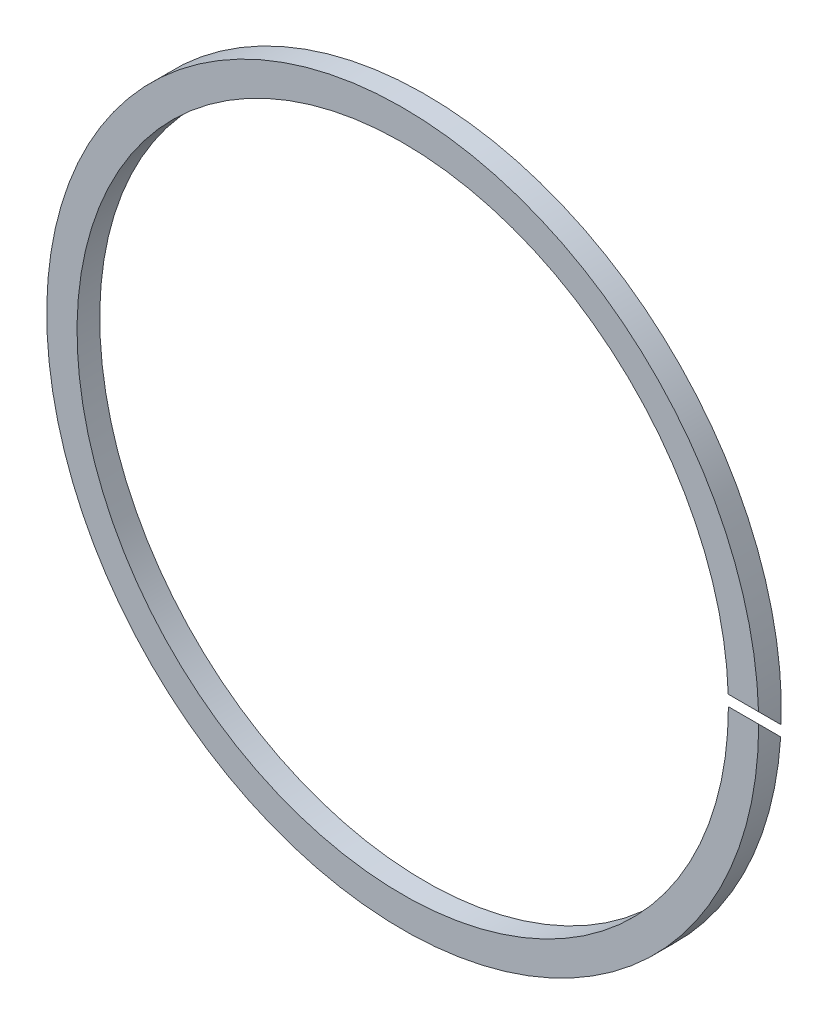
ISO-10303-21;
HEADER;
FILE_DESCRIPTION(('STEP AP214'),'2;1');
FILE_NAME('part.step','',(''),(''),'','','');
FILE_SCHEMA(('AUTOMOTIVE_DESIGN { 1 0 10303 214 1 1 1 1 }'));
ENDSEC;
DATA;
#1=APPLICATION_CONTEXT('core data for automotive mechanical design processes');
#2=APPLICATION_PROTOCOL_DEFINITION('international standard','automotive_design',2000,#1);
#3=PRODUCT_CONTEXT('',#1,'mechanical');
#4=PRODUCT('Part','Part','',(#3));
#5=PRODUCT_RELATED_PRODUCT_CATEGORY('part','',(#4));
#6=PRODUCT_DEFINITION_FORMATION('','',#4);
#7=PRODUCT_DEFINITION_CONTEXT('part definition',#1,'design');
#8=PRODUCT_DEFINITION('design','',#6,#7);
#9=PRODUCT_DEFINITION_SHAPE('','',#8);
#10=(LENGTH_UNIT() NAMED_UNIT(*) SI_UNIT(.MILLI.,.METRE.));
#11=(NAMED_UNIT(*) PLANE_ANGLE_UNIT() SI_UNIT($,.RADIAN.));
#12=(NAMED_UNIT(*) SI_UNIT($,.STERADIAN.) SOLID_ANGLE_UNIT());
#13=UNCERTAINTY_MEASURE_WITH_UNIT(LENGTH_MEASURE(1.E-05),#10,'distance_accuracy_value','');
#14=(GEOMETRIC_REPRESENTATION_CONTEXT(3) GLOBAL_UNCERTAINTY_ASSIGNED_CONTEXT((#13)) GLOBAL_UNIT_ASSIGNED_CONTEXT((#10,
#11,#12)) REPRESENTATION_CONTEXT('',''));
#15=CARTESIAN_POINT('',(0.,0.,0.));
#16=DIRECTION('',(0.,0.,1.));
#17=DIRECTION('',(1.,0.,0.));
#18=AXIS2_PLACEMENT_3D('',#15,#16,#17);
#19=CARTESIAN_POINT('',(0.,0.,3.));
#20=DIRECTION('',(0.,0.,1.));
#21=DIRECTION('',(1.,0.,0.));
#22=AXIS2_PLACEMENT_3D('',#19,#20,#21);
#23=PLANE('',#22);
#24=CARTESIAN_POINT('',(0.,0.,3.));
#25=DIRECTION('',(0.,0.,1.));
#26=DIRECTION('',(1.,0.,0.));
#27=AXIS2_PLACEMENT_3D('',#24,#25,#26);
#28=CIRCLE('',#27,47.);
#29=CARTESIAN_POINT('',(46.9787185861854,1.4142135623731,3.00000000000001));
#30=VERTEX_POINT('',#29);
#31=CARTESIAN_POINT('',(47.,0.,3.));
#32=VERTEX_POINT('',#31);
#33=EDGE_CURVE('E87',#30,#32,#28,.T.);
#34=ORIENTED_EDGE('',*,*,#33,.T.);
#35=DIRECTION('',(-1.,0.,0.));
#36=VECTOR('',#35,1.);
#37=CARTESIAN_POINT('',(47.,0.,3.));
#38=LINE('',#37,#36);
#39=CARTESIAN_POINT('',(43.,0.,3.));
#40=VERTEX_POINT('',#39);
#41=EDGE_CURVE('E74',#32,#40,#38,.T.);
#42=ORIENTED_EDGE('',*,*,#41,.T.);
#43=CARTESIAN_POINT('',(0.,0.,3.));
#44=DIRECTION('',(0.,0.,1.));
#45=DIRECTION('',(1.,0.,0.));
#46=AXIS2_PLACEMENT_3D('',#43,#44,#45);
#47=CIRCLE('',#46,43.);
#48=CARTESIAN_POINT('',(42.9767378938886,1.4142135623731,3.));
#49=VERTEX_POINT('',#48);
#50=EDGE_CURVE('E94',#49,#40,#47,.T.);
#51=ORIENTED_EDGE('',*,*,#50,.F.);
#52=DIRECTION('',(-1.,0.,0.));
#53=VECTOR('',#52,1.);
#54=CARTESIAN_POINT('',(47.,1.4142135623731,3.00000000000001));
#55=LINE('',#54,#53);
#56=EDGE_CURVE('E58',#30,#49,#55,.T.);
#57=ORIENTED_EDGE('',*,*,#56,.F.);
#58=EDGE_LOOP('',(#34,#42,#51,#57));
#59=FACE_BOUND('',#58,.T.);
#60=ADVANCED_FACE('F36',(#59),#23,.T.);
#61=CARTESIAN_POINT('',(0.,0.,0.));
#62=DIRECTION('',(0.,0.,1.));
#63=DIRECTION('',(1.,0.,0.));
#64=AXIS2_PLACEMENT_3D('',#61,#62,#63);
#65=PLANE('',#64);
#66=DIRECTION('',(-1.,0.,0.));
#67=VECTOR('',#66,1.);
#68=CARTESIAN_POINT('',(47.,-3.00000000000004,0.));
#69=LINE('',#68,#67);
#70=CARTESIAN_POINT('',(46.9041575982343,-3.00000000000004,0.));
#71=VERTEX_POINT('',#70);
#72=CARTESIAN_POINT('',(42.8952211790545,-3.00000000000004,0.));
#73=VERTEX_POINT('',#72);
#74=EDGE_CURVE('E51',#71,#73,#69,.T.);
#75=ORIENTED_EDGE('',*,*,#74,.F.);
#76=CARTESIAN_POINT('',(0.,0.,0.));
#77=DIRECTION('',(0.,0.,1.));
#78=DIRECTION('',(1.,0.,0.));
#79=AXIS2_PLACEMENT_3D('',#76,#77,#78);
#80=CIRCLE('',#79,47.);
#81=CARTESIAN_POINT('',(46.9732400561664,-1.58578643762694,0.));
#82=VERTEX_POINT('',#81);
#83=EDGE_CURVE('E89',#82,#71,#80,.T.);
#84=ORIENTED_EDGE('',*,*,#83,.F.);
#85=DIRECTION('',(1.,0.,0.));
#86=VECTOR('',#85,1.);
#87=CARTESIAN_POINT('',(0.,-1.58578643762694,0.));
#88=LINE('',#87,#86);
#89=CARTESIAN_POINT('',(42.9707491367586,-1.58578643762694,0.));
#90=VERTEX_POINT('',#89);
#91=EDGE_CURVE('E82',#90,#82,#88,.T.);
#92=ORIENTED_EDGE('',*,*,#91,.F.);
#93=CARTESIAN_POINT('',(0.,0.,0.));
#94=DIRECTION('',(0.,0.,1.));
#95=DIRECTION('',(1.,0.,0.));
#96=AXIS2_PLACEMENT_3D('',#93,#94,#95);
#97=CIRCLE('',#96,43.);
#98=EDGE_CURVE('E90',#90,#73,#97,.T.);
#99=ORIENTED_EDGE('',*,*,#98,.T.);
#100=EDGE_LOOP('',(#75,#84,#92,#99));
#101=FACE_BOUND('',#100,.T.);
#102=ADVANCED_FACE('F108',(#101),#65,.F.);
#103=CARTESIAN_POINT('',(0.,0.,3.));
#104=DIRECTION('',(0.,0.,-1.));
#105=DIRECTION('',(-1.,0.,0.));
#106=AXIS2_PLACEMENT_3D('',#103,#104,#105);
#107=CYLINDRICAL_SURFACE('',#106,47.);
#108=CARTESIAN_POINT('',(0.,0.,1.58578643762692));
#109=DIRECTION('',(0.,-0.707106781186544,0.707106781186551));
#110=DIRECTION('',(0.,-0.707106781186551,-0.707106781186544));
#111=AXIS2_PLACEMENT_3D('',#108,#109,#110);
#112=ELLIPSE('',#111,66.4680374315351,47.);
#113=EDGE_CURVE('E91',#82,#30,#112,.T.);
#114=ORIENTED_EDGE('',*,*,#113,.F.);
#115=ORIENTED_EDGE('',*,*,#83,.T.);
#116=CARTESIAN_POINT('',(0.,0.,3.));
#117=DIRECTION('',(0.,0.707106781186543,-0.707106781186552));
#118=DIRECTION('',(0.,-0.707106781186552,-0.707106781186543));
#119=AXIS2_PLACEMENT_3D('',#116,#117,#118);
#120=ELLIPSE('',#119,66.4680374315351,47.);
#121=EDGE_CURVE('E77',#32,#71,#120,.T.);
#122=ORIENTED_EDGE('',*,*,#121,.F.);
#123=ORIENTED_EDGE('',*,*,#33,.F.);
#124=EDGE_LOOP('',(#114,#115,#122,#123));
#125=FACE_BOUND('',#124,.T.);
#126=ADVANCED_FACE('F38',(#125),#107,.T.);
#127=CARTESIAN_POINT('',(0.,0.,3.));
#128=DIRECTION('',(0.,0.,-1.));
#129=DIRECTION('',(-1.,0.,0.));
#130=AXIS2_PLACEMENT_3D('',#127,#128,#129);
#131=CYLINDRICAL_SURFACE('',#130,43.);
#132=ORIENTED_EDGE('',*,*,#50,.T.);
#133=CARTESIAN_POINT('',(0.,0.,3.));
#134=DIRECTION('',(0.,0.707106781186543,-0.707106781186552));
#135=DIRECTION('',(0.,-0.707106781186552,-0.707106781186543));
#136=AXIS2_PLACEMENT_3D('',#133,#134,#135);
#137=ELLIPSE('',#136,60.8111831820427,43.);
#138=EDGE_CURVE('E11',#40,#73,#137,.T.);
#139=ORIENTED_EDGE('',*,*,#138,.T.);
#140=ORIENTED_EDGE('',*,*,#98,.F.);
#141=CARTESIAN_POINT('',(0.,0.,1.58578643762692));
#142=DIRECTION('',(0.,-0.707106781186544,0.707106781186551));
#143=DIRECTION('',(0.,-0.707106781186551,-0.707106781186544));
#144=AXIS2_PLACEMENT_3D('',#141,#142,#143);
#145=ELLIPSE('',#144,60.8111831820428,43.);
#146=EDGE_CURVE('E44',#90,#49,#145,.T.);
#147=ORIENTED_EDGE('',*,*,#146,.T.);
#148=EDGE_LOOP('',(#132,#139,#140,#147));
#149=FACE_BOUND('',#148,.T.);
#150=ADVANCED_FACE('F110',(#149),#131,.F.);
#151=CARTESIAN_POINT('',(47.,1.4142135623731,3.00000000000001));
#152=DIRECTION('',(0.,-0.707106781186544,0.707106781186551));
#153=DIRECTION('',(0.,-0.707106781186551,-0.707106781186544));
#154=AXIS2_PLACEMENT_3D('',#151,#152,#153);
#155=PLANE('',#154);
#156=ORIENTED_EDGE('',*,*,#113,.T.);
#157=ORIENTED_EDGE('',*,*,#56,.T.);
#158=ORIENTED_EDGE('',*,*,#146,.F.);
#159=ORIENTED_EDGE('',*,*,#91,.T.);
#160=EDGE_LOOP('',(#156,#157,#158,#159));
#161=FACE_BOUND('',#160,.T.);
#162=ADVANCED_FACE('F105',(#161),#155,.T.);
#163=CARTESIAN_POINT('',(47.,0.,3.));
#164=DIRECTION('',(0.,0.707106781186543,-0.707106781186552));
#165=DIRECTION('',(0.,0.707106781186552,0.707106781186543));
#166=AXIS2_PLACEMENT_3D('',#163,#164,#165);
#167=PLANE('',#166);
#168=ORIENTED_EDGE('',*,*,#121,.T.);
#169=ORIENTED_EDGE('',*,*,#74,.T.);
#170=ORIENTED_EDGE('',*,*,#138,.F.);
#171=ORIENTED_EDGE('',*,*,#41,.F.);
#172=EDGE_LOOP('',(#168,#169,#170,#171));
#173=FACE_BOUND('',#172,.T.);
#174=ADVANCED_FACE('F76',(#173),#167,.T.);
#175=CLOSED_SHELL('',(#60,#102,#126,#150,#162,#174));
#176=MANIFOLD_SOLID_BREP('B2',#175);
#177=ADVANCED_BREP_SHAPE_REPRESENTATION('',(#18,#176),#14);
#178=SHAPE_DEFINITION_REPRESENTATION(#9,#177);
ENDSEC;
END-ISO-10303-21;
